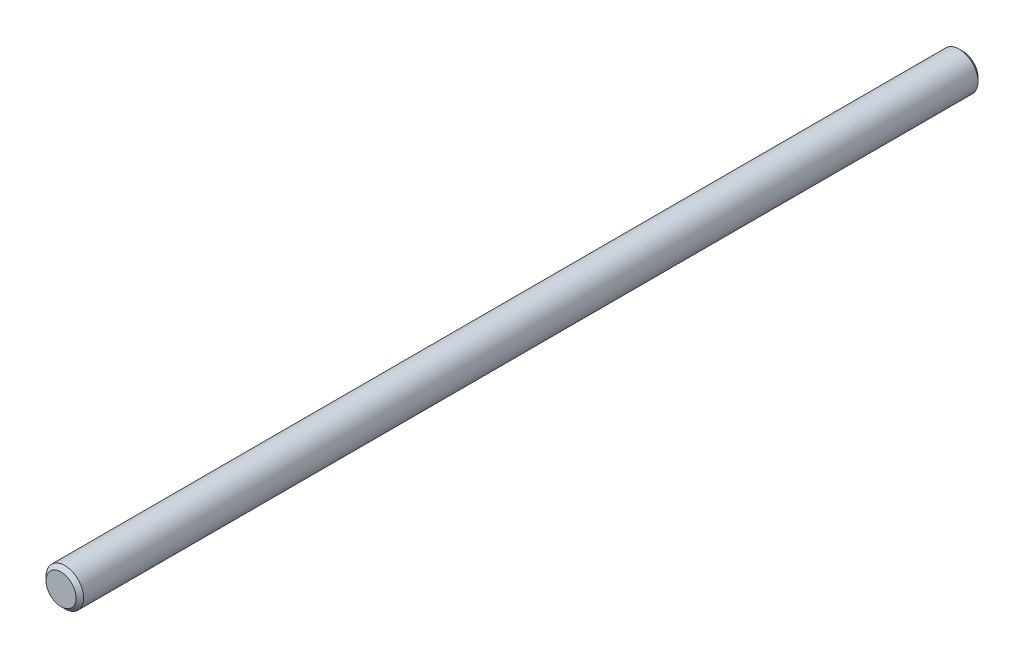
ISO-10303-21;
HEADER;
FILE_DESCRIPTION(('STEP AP214'),'2;1');
FILE_NAME('part.step','',(''),(''),'','','');
FILE_SCHEMA(('AUTOMOTIVE_DESIGN { 1 0 10303 214 1 1 1 1 }'));
ENDSEC;
DATA;
#1=APPLICATION_CONTEXT('core data for automotive mechanical design processes');
#2=APPLICATION_PROTOCOL_DEFINITION('international standard','automotive_design',2000,#1);
#3=PRODUCT_CONTEXT('',#1,'mechanical');
#4=PRODUCT('Part','Part','',(#3));
#5=PRODUCT_RELATED_PRODUCT_CATEGORY('part','',(#4));
#6=PRODUCT_DEFINITION_FORMATION('','',#4);
#7=PRODUCT_DEFINITION_CONTEXT('part definition',#1,'design');
#8=PRODUCT_DEFINITION('design','',#6,#7);
#9=PRODUCT_DEFINITION_SHAPE('','',#8);
#10=(LENGTH_UNIT() NAMED_UNIT(*) SI_UNIT(.MILLI.,.METRE.));
#11=(NAMED_UNIT(*) PLANE_ANGLE_UNIT() SI_UNIT($,.RADIAN.));
#12=(NAMED_UNIT(*) SI_UNIT($,.STERADIAN.) SOLID_ANGLE_UNIT());
#13=UNCERTAINTY_MEASURE_WITH_UNIT(LENGTH_MEASURE(1.E-05),#10,'distance_accuracy_value','');
#14=(GEOMETRIC_REPRESENTATION_CONTEXT(3) GLOBAL_UNCERTAINTY_ASSIGNED_CONTEXT((#13)) GLOBAL_UNIT_ASSIGNED_CONTEXT((#10,
#11,#12)) REPRESENTATION_CONTEXT('',''));
#15=CARTESIAN_POINT('',(0.,0.,0.));
#16=DIRECTION('',(0.,0.,1.));
#17=DIRECTION('',(1.,0.,0.));
#18=AXIS2_PLACEMENT_3D('',#15,#16,#17);
#19=CARTESIAN_POINT('',(0.,0.,38.1));
#20=DIRECTION('',(0.,0.,-1.));
#21=DIRECTION('',(-1.,0.,0.));
#22=AXIS2_PLACEMENT_3D('',#19,#20,#21);
#23=CYLINDRICAL_SURFACE('',#22,1.5875);
#24=CARTESIAN_POINT('',(0.,0.,-37.7824999999999));
#25=DIRECTION('',(0.,0.,1.));
#26=DIRECTION('',(1.,0.,0.));
#27=AXIS2_PLACEMENT_3D('',#24,#25,#26);
#28=CIRCLE('',#27,1.5875);
#29=CARTESIAN_POINT('',(1.5875,0.,-37.7824999999999));
#30=VERTEX_POINT('',#29);
#31=EDGE_CURVE('E43',#30,#30,#28,.T.);
#32=ORIENTED_EDGE('',*,*,#31,.T.);
#33=EDGE_LOOP('',(#32));
#34=FACE_BOUND('',#33,.T.);
#35=CARTESIAN_POINT('',(0.,0.,37.7825));
#36=DIRECTION('',(0.,0.,1.));
#37=DIRECTION('',(1.,0.,0.));
#38=AXIS2_PLACEMENT_3D('',#35,#36,#37);
#39=CIRCLE('',#38,1.5875);
#40=CARTESIAN_POINT('',(1.5875,0.,37.7825));
#41=VERTEX_POINT('',#40);
#42=EDGE_CURVE('E47',#41,#41,#39,.F.);
#43=ORIENTED_EDGE('',*,*,#42,.T.);
#44=EDGE_LOOP('',(#43));
#45=FACE_BOUND('',#44,.T.);
#46=ADVANCED_FACE('F32',(#34,#45),#23,.T.);
#47=CARTESIAN_POINT('',(0.,0.,38.1));
#48=DIRECTION('',(0.,0.,1.));
#49=DIRECTION('',(1.,0.,0.));
#50=AXIS2_PLACEMENT_3D('',#47,#48,#49);
#51=PLANE('',#50);
#52=CARTESIAN_POINT('',(0.,0.,38.1));
#53=DIRECTION('',(0.,0.,1.));
#54=DIRECTION('',(1.,0.,0.));
#55=AXIS2_PLACEMENT_3D('',#52,#53,#54);
#56=CIRCLE('',#55,1.27000000000004);
#57=CARTESIAN_POINT('',(1.27000000000004,0.,38.1));
#58=VERTEX_POINT('',#57);
#59=EDGE_CURVE('E10',#58,#58,#56,.T.);
#60=ORIENTED_EDGE('',*,*,#59,.T.);
#61=EDGE_LOOP('',(#60));
#62=FACE_BOUND('',#61,.T.);
#63=ADVANCED_FACE('F63',(#62),#51,.T.);
#64=CARTESIAN_POINT('',(0.,0.,-38.1));
#65=DIRECTION('',(0.,0.,1.));
#66=DIRECTION('',(1.,0.,0.));
#67=AXIS2_PLACEMENT_3D('',#64,#65,#66);
#68=PLANE('',#67);
#69=CARTESIAN_POINT('',(0.,0.,-38.1));
#70=DIRECTION('',(0.,0.,1.));
#71=DIRECTION('',(1.,0.,0.));
#72=AXIS2_PLACEMENT_3D('',#69,#70,#71);
#73=CIRCLE('',#72,1.26999999999994);
#74=CARTESIAN_POINT('',(1.26999999999994,0.,-38.1));
#75=VERTEX_POINT('',#74);
#76=EDGE_CURVE('E39',#75,#75,#73,.F.);
#77=ORIENTED_EDGE('',*,*,#76,.T.);
#78=EDGE_LOOP('',(#77));
#79=FACE_BOUND('',#78,.T.);
#80=ADVANCED_FACE('F60',(#79),#68,.F.);
#81=CARTESIAN_POINT('',(0.,0.,-37.7824999999999));
#82=DIRECTION('',(0.,0.,1.));
#83=DIRECTION('',(1.,0.,0.));
#84=AXIS2_PLACEMENT_3D('',#81,#82,#83);
#85=CONICAL_SURFACE('',#84,1.5875,0.78539816339744);
#86=ORIENTED_EDGE('',*,*,#76,.F.);
#87=EDGE_LOOP('',(#86));
#88=FACE_BOUND('',#87,.T.);
#89=ORIENTED_EDGE('',*,*,#31,.F.);
#90=EDGE_LOOP('',(#89));
#91=FACE_BOUND('',#90,.T.);
#92=ADVANCED_FACE('F56',(#88,#91),#85,.T.);
#93=CARTESIAN_POINT('',(0.,0.,38.1));
#94=DIRECTION('',(0.,0.,-1.));
#95=DIRECTION('',(-1.,0.,0.));
#96=AXIS2_PLACEMENT_3D('',#93,#94,#95);
#97=CONICAL_SURFACE('',#96,1.27000000000004,0.785398163397451);
#98=ORIENTED_EDGE('',*,*,#42,.F.);
#99=EDGE_LOOP('',(#98));
#100=FACE_BOUND('',#99,.T.);
#101=ORIENTED_EDGE('',*,*,#59,.F.);
#102=EDGE_LOOP('',(#101));
#103=FACE_BOUND('',#102,.T.);
#104=ADVANCED_FACE('F34',(#100,#103),#97,.T.);
#105=CLOSED_SHELL('',(#46,#63,#80,#92,#104));
#106=MANIFOLD_SOLID_BREP('B2',#105);
#107=ADVANCED_BREP_SHAPE_REPRESENTATION('',(#18,#106),#14);
#108=SHAPE_DEFINITION_REPRESENTATION(#9,#107);
ENDSEC;
END-ISO-10303-21;
